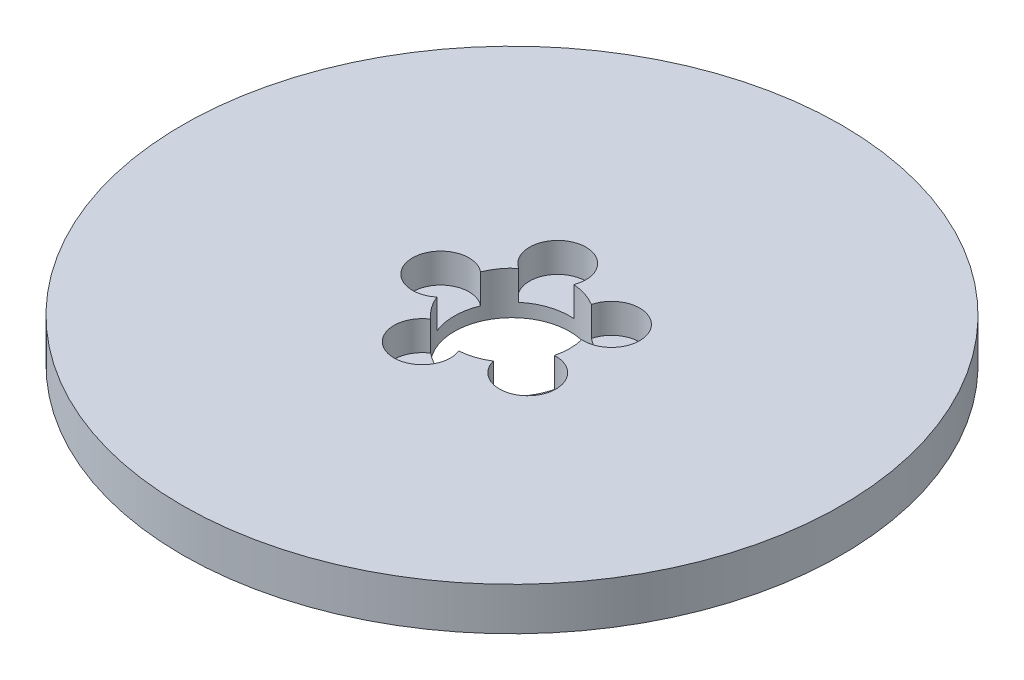
ISO-10303-21;
HEADER;
FILE_DESCRIPTION(('STEP AP214'),'2;1');
FILE_NAME('part.step','',(''),(''),'','','');
FILE_SCHEMA(('AUTOMOTIVE_DESIGN { 1 0 10303 214 1 1 1 1 }'));
ENDSEC;
DATA;
#1=APPLICATION_CONTEXT('core data for automotive mechanical design processes');
#2=APPLICATION_PROTOCOL_DEFINITION('international standard','automotive_design',2000,#1);
#3=PRODUCT_CONTEXT('',#1,'mechanical');
#4=PRODUCT('Part','Part','',(#3));
#5=PRODUCT_RELATED_PRODUCT_CATEGORY('part','',(#4));
#6=PRODUCT_DEFINITION_FORMATION('','',#4);
#7=PRODUCT_DEFINITION_CONTEXT('part definition',#1,'design');
#8=PRODUCT_DEFINITION('design','',#6,#7);
#9=PRODUCT_DEFINITION_SHAPE('','',#8);
#10=(LENGTH_UNIT() NAMED_UNIT(*) SI_UNIT(.MILLI.,.METRE.));
#11=(NAMED_UNIT(*) PLANE_ANGLE_UNIT() SI_UNIT($,.RADIAN.));
#12=(NAMED_UNIT(*) SI_UNIT($,.STERADIAN.) SOLID_ANGLE_UNIT());
#13=UNCERTAINTY_MEASURE_WITH_UNIT(LENGTH_MEASURE(1.E-05),#10,'distance_accuracy_value','');
#14=(GEOMETRIC_REPRESENTATION_CONTEXT(3) GLOBAL_UNCERTAINTY_ASSIGNED_CONTEXT((#13)) GLOBAL_UNIT_ASSIGNED_CONTEXT((#10,
#11,#12)) REPRESENTATION_CONTEXT('',''));
#15=CARTESIAN_POINT('',(0.,0.,0.));
#16=DIRECTION('',(0.,0.,1.));
#17=DIRECTION('',(1.,0.,0.));
#18=AXIS2_PLACEMENT_3D('',#15,#16,#17);
#19=CARTESIAN_POINT('',(0.,13.,0.));
#20=DIRECTION('',(0.,-1.,0.));
#21=DIRECTION('',(0.,0.,-1.));
#22=AXIS2_PLACEMENT_3D('',#19,#20,#21);
#23=CYLINDRICAL_SURFACE('',#22,100.);
#24=CARTESIAN_POINT('',(0.,13.,0.));
#25=DIRECTION('',(0.,1.,0.));
#26=DIRECTION('',(0.,0.,1.));
#27=AXIS2_PLACEMENT_3D('',#24,#25,#26);
#28=CIRCLE('',#27,100.);
#29=CARTESIAN_POINT('',(0.,13.,-100.));
#30=VERTEX_POINT('',#29);
#31=EDGE_CURVE('E157',#30,#30,#28,.T.);
#32=CARTESIAN_POINT('',(0.,0.,0.));
#33=DIRECTION('',(0.,1.,0.));
#34=DIRECTION('',(0.,0.,1.));
#35=AXIS2_PLACEMENT_3D('',#32,#33,#34);
#36=CIRCLE('',#35,100.);
#37=CARTESIAN_POINT('',(0.,0.,-100.));
#38=VERTEX_POINT('',#37);
#39=EDGE_CURVE('E150',#38,#38,#36,.T.);
#40=CARTESIAN_POINT('',(0.,13.,-100.));
#41=CARTESIAN_POINT('',(0.,12.8645833333333,-100.));
#42=CARTESIAN_POINT('',(0.,12.7291666666667,-100.));
#43=CARTESIAN_POINT('',(0.,12.4583333333333,-100.));
#44=CARTESIAN_POINT('',(0.,12.3229166666667,-100.));
#45=CARTESIAN_POINT('',(0.,12.0520833333333,-100.));
#46=CARTESIAN_POINT('',(0.,11.9166666666667,-100.));
#47=CARTESIAN_POINT('',(0.,11.6458333333333,-100.));
#48=CARTESIAN_POINT('',(0.,11.5104166666667,-100.));
#49=CARTESIAN_POINT('',(0.,11.2395833333333,-100.));
#50=CARTESIAN_POINT('',(0.,11.1041666666667,-100.));
#51=CARTESIAN_POINT('',(0.,10.8333333333333,-100.));
#52=CARTESIAN_POINT('',(0.,10.6979166666667,-100.));
#53=CARTESIAN_POINT('',(0.,10.4270833333333,-100.));
#54=CARTESIAN_POINT('',(0.,10.2916666666667,-100.));
#55=CARTESIAN_POINT('',(0.,10.0208333333333,-100.));
#56=CARTESIAN_POINT('',(0.,9.88541666666667,-100.));
#57=CARTESIAN_POINT('',(0.,9.61458333333333,-100.));
#58=CARTESIAN_POINT('',(0.,9.47916666666667,-100.));
#59=CARTESIAN_POINT('',(0.,9.20833333333333,-100.));
#60=CARTESIAN_POINT('',(0.,9.07291666666666,-100.));
#61=CARTESIAN_POINT('',(0.,8.80208333333333,-100.));
#62=CARTESIAN_POINT('',(0.,8.66666666666667,-100.));
#63=CARTESIAN_POINT('',(0.,8.39583333333333,-100.));
#64=CARTESIAN_POINT('',(0.,8.26041666666667,-100.));
#65=CARTESIAN_POINT('',(0.,7.98958333333333,-100.));
#66=CARTESIAN_POINT('',(0.,7.85416666666667,-100.));
#67=CARTESIAN_POINT('',(0.,7.58333333333333,-100.));
#68=CARTESIAN_POINT('',(0.,7.44791666666667,-100.));
#69=CARTESIAN_POINT('',(0.,7.17708333333333,-100.));
#70=CARTESIAN_POINT('',(0.,7.04166666666667,-100.));
#71=CARTESIAN_POINT('',(0.,6.77083333333333,-100.));
#72=CARTESIAN_POINT('',(0.,6.63541666666667,-100.));
#73=CARTESIAN_POINT('',(0.,6.36458333333333,-100.));
#74=CARTESIAN_POINT('',(0.,6.22916666666667,-100.));
#75=CARTESIAN_POINT('',(0.,5.95833333333333,-100.));
#76=CARTESIAN_POINT('',(0.,5.82291666666667,-100.));
#77=CARTESIAN_POINT('',(0.,5.55208333333333,-100.));
#78=CARTESIAN_POINT('',(0.,5.41666666666667,-100.));
#79=CARTESIAN_POINT('',(0.,5.14583333333333,-100.));
#80=CARTESIAN_POINT('',(0.,5.01041666666667,-100.));
#81=CARTESIAN_POINT('',(0.,4.73958333333333,-100.));
#82=CARTESIAN_POINT('',(0.,4.60416666666667,-100.));
#83=CARTESIAN_POINT('',(0.,4.33333333333333,-100.));
#84=CARTESIAN_POINT('',(0.,4.19791666666667,-100.));
#85=CARTESIAN_POINT('',(0.,3.92708333333333,-100.));
#86=CARTESIAN_POINT('',(0.,3.79166666666667,-100.));
#87=CARTESIAN_POINT('',(0.,3.52083333333333,-100.));
#88=CARTESIAN_POINT('',(0.,3.38541666666667,-100.));
#89=CARTESIAN_POINT('',(0.,3.11458333333333,-100.));
#90=CARTESIAN_POINT('',(0.,2.97916666666667,-100.));
#91=CARTESIAN_POINT('',(0.,2.70833333333333,-100.));
#92=CARTESIAN_POINT('',(0.,2.57291666666667,-100.));
#93=CARTESIAN_POINT('',(0.,2.30208333333333,-100.));
#94=CARTESIAN_POINT('',(0.,2.16666666666667,-100.));
#95=CARTESIAN_POINT('',(0.,1.89583333333333,-100.));
#96=CARTESIAN_POINT('',(0.,1.76041666666667,-100.));
#97=CARTESIAN_POINT('',(0.,1.48958333333333,-100.));
#98=CARTESIAN_POINT('',(0.,1.35416666666667,-100.));
#99=CARTESIAN_POINT('',(0.,1.08333333333333,-100.));
#100=CARTESIAN_POINT('',(0.,0.947916666666667,-100.));
#101=CARTESIAN_POINT('',(0.,0.677083333333334,-100.));
#102=CARTESIAN_POINT('',(0.,0.541666666666667,-100.));
#103=CARTESIAN_POINT('',(0.,0.270833333333334,-100.));
#104=CARTESIAN_POINT('',(0.,0.135416666666667,-100.));
#105=CARTESIAN_POINT('',(0.,0.,-100.));
#106=B_SPLINE_CURVE_WITH_KNOTS('',3,(#40,#41,#42,#43,#44,#45,#46,#47,#48,#49,#50,#51,#52,#53,
#54,#55,#56,#57,#58,#59,#60,#61,#62,#63,#64,#65,#66,#67,#68,#69,#70,#71,#72,#73,#74,#75,#76,#77,
#78,#79,#80,#81,#82,#83,#84,#85,#86,#87,#88,#89,#90,#91,#92,#93,#94,#95,#96,#97,#98,#99,#100,
#101,#102,#103,#104,#105),.UNSPECIFIED.,.F.,.F.,(4,2,2,2,2,2,2,2,2,2,2,2,2,2,2,2,2,2,2,2,2,2,2,
2,2,2,2,2,2,2,2,2,4),(0.,0.40625,0.812500000000001,1.21875,1.625,2.03125,2.4375,2.84375,3.25,
3.65625,4.0625,4.46875,4.875,5.28125,5.6875,6.09375,6.5,6.90625,7.3125,7.71875,8.125,8.53125,
8.9375,9.34375,9.75,10.15625,10.5625,10.96875,11.375,11.78125,12.1875,12.59375,13.),.UNSPECIFIED.);
#107=EDGE_CURVE('BSEAM39',#30,#38,#106,.T.);
#108=ORIENTED_EDGE('',*,*,#31,.F.);
#109=ORIENTED_EDGE('',*,*,#39,.T.);
#110=ORIENTED_EDGE('',*,*,#107,.T.);
#111=ORIENTED_EDGE('',*,*,#107,.F.);
#112=EDGE_LOOP('',(#108,#110,#109,#111));
#113=FACE_BOUND('',#112,.T.);
#114=ADVANCED_FACE('F39',(#113),#23,.T.);
#115=CARTESIAN_POINT('',(0.,13.,0.));
#116=DIRECTION('',(0.,1.,0.));
#117=DIRECTION('',(0.,0.,1.));
#118=AXIS2_PLACEMENT_3D('',#115,#116,#117);
#119=PLANE('',#118);
#120=CARTESIAN_POINT('',(-6.68037932786835,13.,-20.5600934794655));
#121=DIRECTION('',(0.,1.,0.));
#122=DIRECTION('',(-0.95105651629515,0.,0.309016994374958));
#123=AXIS2_PLACEMENT_3D('',#120,#121,#122);
#124=CIRCLE('',#123,8.57014910752635);
#125=CARTESIAN_POINT('',(1.30599873361544,13.,-17.4511995950936));
#126=VERTEX_POINT('',#125);
#127=CARTESIAN_POINT('',(-11.3141329269358,13.,-13.3506702495279));
#128=VERTEX_POINT('',#127);
#129=EDGE_CURVE('E194',#126,#128,#124,.T.);
#130=ORIENTED_EDGE('',*,*,#129,.F.);
#131=CARTESIAN_POINT('',(0.,13.,0.));
#132=DIRECTION('',(0.,1.,0.));
#133=DIRECTION('',(0.,0.,1.));
#134=AXIS2_PLACEMENT_3D('',#131,#132,#133);
#135=CIRCLE('',#134,17.5);
#136=CARTESIAN_POINT('',(9.20098258668104,13.,-14.8859638397919));
#137=VERTEX_POINT('',#136);
#138=EDGE_CURVE('E147',#137,#126,#135,.T.);
#139=ORIENTED_EDGE('',*,*,#138,.F.);
#140=CARTESIAN_POINT('',(17.4894601381008,13.,-12.706836582185));
#141=DIRECTION('',(0.,1.,0.));
#142=DIRECTION('',(-0.58778525229248,0.,-0.809016994374942));
#143=AXIS2_PLACEMENT_3D('',#140,#141,#142);
#144=CIRCLE('',#143,8.57014910752635);
#145=CARTESIAN_POINT('',(17.0006528954005,13.,-4.15063864123489));
#146=VERTEX_POINT('',#145);
#147=EDGE_CURVE('E254',#146,#137,#144,.T.);
#148=ORIENTED_EDGE('',*,*,#147,.F.);
#149=CARTESIAN_POINT('',(17.0006528954005,13.,4.15063864123465));
#150=VERTEX_POINT('',#149);
#151=EDGE_CURVE('E144',#150,#146,#135,.T.);
#152=ORIENTED_EDGE('',*,*,#151,.F.);
#153=CARTESIAN_POINT('',(17.489460138101,13.,12.7068365821847));
#154=DIRECTION('',(0.,1.,0.));
#155=DIRECTION('',(0.587785252292469,0.,-0.809016994374951));
#156=AXIS2_PLACEMENT_3D('',#153,#154,#155);
#157=CIRCLE('',#156,8.57014910752635);
#158=CARTESIAN_POINT('',(9.20098258668126,13.,14.8859638397918));
#159=VERTEX_POINT('',#158);
#160=EDGE_CURVE('E141',#159,#150,#157,.T.);
#161=ORIENTED_EDGE('',*,*,#160,.F.);
#162=CARTESIAN_POINT('',(1.30599873361569,13.,17.4511995950936));
#163=VERTEX_POINT('',#162);
#164=EDGE_CURVE('E134',#163,#159,#135,.T.);
#165=ORIENTED_EDGE('',*,*,#164,.F.);
#166=CARTESIAN_POINT('',(-6.68037932786806,13.,20.5600934794656));
#167=DIRECTION('',(0.,1.,0.));
#168=DIRECTION('',(0.951056516295155,0.,0.309016994374945));
#169=AXIS2_PLACEMENT_3D('',#166,#167,#168);
#170=CIRCLE('',#169,8.57014910752635);
#171=CARTESIAN_POINT('',(-11.3141329269356,13.,13.350670249528));
#172=VERTEX_POINT('',#171);
#173=EDGE_CURVE('E111',#172,#163,#170,.T.);
#174=ORIENTED_EDGE('',*,*,#173,.F.);
#175=CARTESIAN_POINT('',(-16.1935012887617,13.,6.63479585299149));
#176=VERTEX_POINT('',#175);
#177=EDGE_CURVE('E145',#176,#172,#135,.T.);
#178=ORIENTED_EDGE('',*,*,#177,.F.);
#179=CARTESIAN_POINT('',(-21.6181616204656,13.,0.));
#180=DIRECTION('',(0.,1.,0.));
#181=DIRECTION('',(0.,0.,1.));
#182=AXIS2_PLACEMENT_3D('',#179,#180,#181);
#183=CIRCLE('',#182,8.57014910752635);
#184=CARTESIAN_POINT('',(-16.1935012887617,13.,-6.63479585299149));
#185=VERTEX_POINT('',#184);
#186=EDGE_CURVE('E153',#185,#176,#183,.T.);
#187=ORIENTED_EDGE('',*,*,#186,.F.);
#188=EDGE_CURVE('E146',#128,#185,#135,.T.);
#189=ORIENTED_EDGE('',*,*,#188,.F.);
#190=EDGE_LOOP('',(#130,#139,#148,#152,#161,#165,#174,#178,#187,#189));
#191=FACE_BOUND('',#190,.T.);
#192=ORIENTED_EDGE('',*,*,#31,.T.);
#193=EDGE_LOOP('',(#192));
#194=FACE_BOUND('',#193,.T.);
#195=ADVANCED_FACE('F139',(#191,#194),#119,.T.);
#196=CARTESIAN_POINT('',(0.,0.,0.));
#197=DIRECTION('',(0.,1.,0.));
#198=DIRECTION('',(0.,0.,1.));
#199=AXIS2_PLACEMENT_3D('',#196,#197,#198);
#200=PLANE('',#199);
#201=CARTESIAN_POINT('',(0.,0.,0.));
#202=DIRECTION('',(0.,1.,0.));
#203=DIRECTION('',(0.,0.,1.));
#204=AXIS2_PLACEMENT_3D('',#201,#202,#203);
#205=CIRCLE('',#204,17.5);
#206=CARTESIAN_POINT('',(0.,0.,17.5));
#207=VERTEX_POINT('',#206);
#208=EDGE_CURVE('E154',#207,#207,#205,.T.);
#209=ORIENTED_EDGE('',*,*,#208,.T.);
#210=EDGE_LOOP('',(#209));
#211=FACE_BOUND('',#210,.T.);
#212=ORIENTED_EDGE('',*,*,#39,.F.);
#213=EDGE_LOOP('',(#212));
#214=FACE_BOUND('',#213,.T.);
#215=ADVANCED_FACE('F213',(#211,#214),#200,.F.);
#216=CARTESIAN_POINT('',(0.,13.,0.));
#217=DIRECTION('',(0.,-1.,0.));
#218=DIRECTION('',(0.,0.,-1.));
#219=AXIS2_PLACEMENT_3D('',#216,#217,#218);
#220=CYLINDRICAL_SURFACE('',#219,17.5);
#221=DIRECTION('',(0.,1.,0.));
#222=VECTOR('',#221,1.);
#223=CARTESIAN_POINT('',(1.30599873361544,8.53133186818055,-17.4511995950936));
#224=LINE('',#223,#222);
#225=CARTESIAN_POINT('',(1.30599873361544,4.06266373636111,-17.4511995950936));
#226=VERTEX_POINT('',#225);
#227=EDGE_CURVE('E11',#226,#126,#224,.T.);
#228=ORIENTED_EDGE('',*,*,#227,.F.);
#229=CARTESIAN_POINT('',(0.,4.06266373636111,0.));
#230=DIRECTION('',(0.,1.,0.));
#231=DIRECTION('',(0.,0.,1.));
#232=AXIS2_PLACEMENT_3D('',#229,#230,#231);
#233=CIRCLE('',#232,17.5);
#234=CARTESIAN_POINT('',(-11.3141329269358,4.06266373636111,-13.3506702495279));
#235=VERTEX_POINT('',#234);
#236=EDGE_CURVE('E189',#226,#235,#233,.T.);
#237=ORIENTED_EDGE('',*,*,#236,.T.);
#238=DIRECTION('',(0.,1.,0.));
#239=VECTOR('',#238,1.);
#240=CARTESIAN_POINT('',(-11.3141329269358,8.53133186818055,-13.3506702495279));
#241=LINE('',#240,#239);
#242=EDGE_CURVE('E46',#128,#235,#241,.F.);
#243=ORIENTED_EDGE('',*,*,#242,.F.);
#244=ORIENTED_EDGE('',*,*,#188,.T.);
#245=DIRECTION('',(0.,1.,0.));
#246=VECTOR('',#245,1.);
#247=CARTESIAN_POINT('',(-16.1935012887617,8.53133186818055,-6.63479585299149));
#248=LINE('',#247,#246);
#249=CARTESIAN_POINT('',(-16.1935012887617,4.06266373636111,-6.63479585299149));
#250=VERTEX_POINT('',#249);
#251=EDGE_CURVE('E168',#250,#185,#248,.T.);
#252=ORIENTED_EDGE('',*,*,#251,.F.);
#253=CARTESIAN_POINT('',(0.,4.06266373636111,0.));
#254=DIRECTION('',(0.,1.,0.));
#255=DIRECTION('',(0.,0.,1.));
#256=AXIS2_PLACEMENT_3D('',#253,#254,#255);
#257=CIRCLE('',#256,17.5);
#258=CARTESIAN_POINT('',(-16.1935012887617,4.06266373636111,6.63479585299149));
#259=VERTEX_POINT('',#258);
#260=EDGE_CURVE('E165',#250,#259,#257,.T.);
#261=ORIENTED_EDGE('',*,*,#260,.T.);
#262=DIRECTION('',(0.,1.,0.));
#263=VECTOR('',#262,1.);
#264=CARTESIAN_POINT('',(-16.1935012887617,8.53133186818055,6.63479585299149));
#265=LINE('',#264,#263);
#266=EDGE_CURVE('E170',#176,#259,#265,.F.);
#267=ORIENTED_EDGE('',*,*,#266,.F.);
#268=ORIENTED_EDGE('',*,*,#177,.T.);
#269=DIRECTION('',(0.,1.,0.));
#270=VECTOR('',#269,1.);
#271=CARTESIAN_POINT('',(-11.3141329269356,8.53133186818055,13.350670249528));
#272=LINE('',#271,#270);
#273=CARTESIAN_POINT('',(-11.3141329269356,4.06266373636111,13.350670249528));
#274=VERTEX_POINT('',#273);
#275=EDGE_CURVE('E121',#274,#172,#272,.T.);
#276=ORIENTED_EDGE('',*,*,#275,.F.);
#277=CARTESIAN_POINT('',(0.,4.06266373636111,0.));
#278=DIRECTION('',(0.,1.,0.));
#279=DIRECTION('',(0.,0.,1.));
#280=AXIS2_PLACEMENT_3D('',#277,#278,#279);
#281=CIRCLE('',#280,17.5);
#282=CARTESIAN_POINT('',(1.30599873361569,4.06266373636111,17.4511995950936));
#283=VERTEX_POINT('',#282);
#284=EDGE_CURVE('E136',#274,#283,#281,.T.);
#285=ORIENTED_EDGE('',*,*,#284,.T.);
#286=DIRECTION('',(0.,1.,0.));
#287=VECTOR('',#286,1.);
#288=CARTESIAN_POINT('',(1.30599873361569,8.53133186818055,17.4511995950936));
#289=LINE('',#288,#287);
#290=EDGE_CURVE('E117',#163,#283,#289,.F.);
#291=ORIENTED_EDGE('',*,*,#290,.F.);
#292=ORIENTED_EDGE('',*,*,#164,.T.);
#293=DIRECTION('',(0.,1.,0.));
#294=VECTOR('',#293,1.);
#295=CARTESIAN_POINT('',(9.20098258668126,8.53133186818055,14.8859638397918));
#296=LINE('',#295,#294);
#297=CARTESIAN_POINT('',(9.20098258668126,4.06266373636111,14.8859638397918));
#298=VERTEX_POINT('',#297);
#299=EDGE_CURVE('E182',#298,#159,#296,.T.);
#300=ORIENTED_EDGE('',*,*,#299,.F.);
#301=CARTESIAN_POINT('',(0.,4.06266373636111,0.));
#302=DIRECTION('',(0.,1.,0.));
#303=DIRECTION('',(0.,0.,1.));
#304=AXIS2_PLACEMENT_3D('',#301,#302,#303);
#305=CIRCLE('',#304,17.5);
#306=CARTESIAN_POINT('',(17.0006528954005,4.06266373636111,4.15063864123465));
#307=VERTEX_POINT('',#306);
#308=EDGE_CURVE('E174',#298,#307,#305,.T.);
#309=ORIENTED_EDGE('',*,*,#308,.T.);
#310=DIRECTION('',(0.,1.,0.));
#311=VECTOR('',#310,1.);
#312=CARTESIAN_POINT('',(17.0006528954005,8.53133186818055,4.15063864123465));
#313=LINE('',#312,#311);
#314=EDGE_CURVE('E177',#150,#307,#313,.F.);
#315=ORIENTED_EDGE('',*,*,#314,.F.);
#316=ORIENTED_EDGE('',*,*,#151,.T.);
#317=DIRECTION('',(0.,1.,0.));
#318=VECTOR('',#317,1.);
#319=CARTESIAN_POINT('',(17.0006528954005,8.53133186818055,-4.15063864123489));
#320=LINE('',#319,#318);
#321=CARTESIAN_POINT('',(17.0006528954005,4.06266373636111,-4.15063864123489));
#322=VERTEX_POINT('',#321);
#323=EDGE_CURVE('E187',#322,#146,#320,.T.);
#324=ORIENTED_EDGE('',*,*,#323,.F.);
#325=CARTESIAN_POINT('',(0.,4.06266373636111,0.));
#326=DIRECTION('',(0.,1.,0.));
#327=DIRECTION('',(0.,0.,1.));
#328=AXIS2_PLACEMENT_3D('',#325,#326,#327);
#329=CIRCLE('',#328,17.5);
#330=CARTESIAN_POINT('',(9.20098258668104,4.06266373636111,-14.8859638397919));
#331=VERTEX_POINT('',#330);
#332=EDGE_CURVE('E181',#322,#331,#329,.T.);
#333=ORIENTED_EDGE('',*,*,#332,.T.);
#334=DIRECTION('',(0.,1.,0.));
#335=VECTOR('',#334,1.);
#336=CARTESIAN_POINT('',(9.20098258668104,8.53133186818055,-14.8859638397919));
#337=LINE('',#336,#335);
#338=EDGE_CURVE('E186',#137,#331,#337,.F.);
#339=ORIENTED_EDGE('',*,*,#338,.F.);
#340=ORIENTED_EDGE('',*,*,#138,.T.);
#341=EDGE_LOOP('',(#228,#237,#243,#244,#252,#261,#267,#268,#276,#285,#291,#292,#300,#309,#315,
#316,#324,#333,#339,#340));
#342=FACE_BOUND('',#341,.T.);
#343=ORIENTED_EDGE('',*,*,#208,.F.);
#344=EDGE_LOOP('',(#343));
#345=FACE_BOUND('',#344,.T.);
#346=ADVANCED_FACE('F135',(#342,#345),#220,.F.);
#347=CARTESIAN_POINT('',(-21.6181616204656,4.06266373636111,0.));
#348=DIRECTION('',(0.,1.,0.));
#349=DIRECTION('',(0.,0.,1.));
#350=AXIS2_PLACEMENT_3D('',#347,#348,#349);
#351=CYLINDRICAL_SURFACE('',#350,8.57014910752635);
#352=ORIENTED_EDGE('',*,*,#251,.T.);
#353=ORIENTED_EDGE('',*,*,#186,.T.);
#354=ORIENTED_EDGE('',*,*,#266,.T.);
#355=CARTESIAN_POINT('',(-21.6181616204656,4.06266373636111,0.));
#356=DIRECTION('',(0.,1.,0.));
#357=DIRECTION('',(0.,0.,1.));
#358=AXIS2_PLACEMENT_3D('',#355,#356,#357);
#359=CIRCLE('',#358,8.57014910752635);
#360=EDGE_CURVE('E158',#250,#259,#359,.T.);
#361=ORIENTED_EDGE('',*,*,#360,.F.);
#362=EDGE_LOOP('',(#352,#353,#354,#361));
#363=FACE_BOUND('',#362,.T.);
#364=ADVANCED_FACE('F221',(#363),#351,.F.);
#365=CARTESIAN_POINT('',(-21.6181616204656,4.06266373636111,0.));
#366=DIRECTION('',(0.,1.,0.));
#367=DIRECTION('',(0.,0.,1.));
#368=AXIS2_PLACEMENT_3D('',#365,#366,#367);
#369=PLANE('',#368);
#370=ORIENTED_EDGE('',*,*,#360,.T.);
#371=ORIENTED_EDGE('',*,*,#260,.F.);
#372=EDGE_LOOP('',(#370,#371));
#373=FACE_BOUND('',#372,.T.);
#374=ADVANCED_FACE('F227',(#373),#369,.T.);
#375=CARTESIAN_POINT('',(-6.68037932786806,4.06266373636111,20.5600934794656));
#376=DIRECTION('',(0.,1.,0.));
#377=DIRECTION('',(0.,0.,1.));
#378=AXIS2_PLACEMENT_3D('',#375,#376,#377);
#379=CYLINDRICAL_SURFACE('',#378,8.57014910752635);
#380=ORIENTED_EDGE('',*,*,#275,.T.);
#381=ORIENTED_EDGE('',*,*,#173,.T.);
#382=ORIENTED_EDGE('',*,*,#290,.T.);
#383=CARTESIAN_POINT('',(-6.68037932786806,4.06266373636111,20.5600934794656));
#384=DIRECTION('',(0.,1.,0.));
#385=DIRECTION('',(0.951056516295155,0.,0.309016994374945));
#386=AXIS2_PLACEMENT_3D('',#383,#384,#385);
#387=CIRCLE('',#386,8.57014910752635);
#388=EDGE_CURVE('E127',#274,#283,#387,.T.);
#389=ORIENTED_EDGE('',*,*,#388,.F.);
#390=EDGE_LOOP('',(#380,#381,#382,#389));
#391=FACE_BOUND('',#390,.T.);
#392=ADVANCED_FACE('F116',(#391),#379,.F.);
#393=CARTESIAN_POINT('',(-6.68037932786806,4.06266373636111,20.5600934794656));
#394=DIRECTION('',(0.,1.,0.));
#395=DIRECTION('',(0.951056516295155,0.,0.309016994374945));
#396=AXIS2_PLACEMENT_3D('',#393,#394,#395);
#397=PLANE('',#396);
#398=ORIENTED_EDGE('',*,*,#388,.T.);
#399=ORIENTED_EDGE('',*,*,#284,.F.);
#400=EDGE_LOOP('',(#398,#399));
#401=FACE_BOUND('',#400,.T.);
#402=ADVANCED_FACE('F234',(#401),#397,.T.);
#403=CARTESIAN_POINT('',(17.489460138101,4.06266373636111,12.7068365821847));
#404=DIRECTION('',(0.,1.,0.));
#405=DIRECTION('',(0.,0.,1.));
#406=AXIS2_PLACEMENT_3D('',#403,#404,#405);
#407=CYLINDRICAL_SURFACE('',#406,8.57014910752635);
#408=ORIENTED_EDGE('',*,*,#299,.T.);
#409=ORIENTED_EDGE('',*,*,#160,.T.);
#410=ORIENTED_EDGE('',*,*,#314,.T.);
#411=CARTESIAN_POINT('',(17.489460138101,4.06266373636111,12.7068365821847));
#412=DIRECTION('',(0.,1.,0.));
#413=DIRECTION('',(0.587785252292469,0.,-0.809016994374951));
#414=AXIS2_PLACEMENT_3D('',#411,#412,#413);
#415=CIRCLE('',#414,8.57014910752635);
#416=EDGE_CURVE('E130',#298,#307,#415,.T.);
#417=ORIENTED_EDGE('',*,*,#416,.F.);
#418=EDGE_LOOP('',(#408,#409,#410,#417));
#419=FACE_BOUND('',#418,.T.);
#420=ADVANCED_FACE('F240',(#419),#407,.F.);
#421=CARTESIAN_POINT('',(17.489460138101,4.06266373636111,12.7068365821847));
#422=DIRECTION('',(0.,1.,0.));
#423=DIRECTION('',(0.587785252292469,0.,-0.809016994374951));
#424=AXIS2_PLACEMENT_3D('',#421,#422,#423);
#425=PLANE('',#424);
#426=ORIENTED_EDGE('',*,*,#416,.T.);
#427=ORIENTED_EDGE('',*,*,#308,.F.);
#428=EDGE_LOOP('',(#426,#427));
#429=FACE_BOUND('',#428,.T.);
#430=ADVANCED_FACE('F245',(#429),#425,.T.);
#431=CARTESIAN_POINT('',(17.4894601381008,4.06266373636111,-12.706836582185));
#432=DIRECTION('',(0.,1.,0.));
#433=DIRECTION('',(0.,0.,1.));
#434=AXIS2_PLACEMENT_3D('',#431,#432,#433);
#435=CYLINDRICAL_SURFACE('',#434,8.57014910752635);
#436=ORIENTED_EDGE('',*,*,#323,.T.);
#437=ORIENTED_EDGE('',*,*,#147,.T.);
#438=ORIENTED_EDGE('',*,*,#338,.T.);
#439=CARTESIAN_POINT('',(17.4894601381008,4.06266373636111,-12.706836582185));
#440=DIRECTION('',(0.,1.,0.));
#441=DIRECTION('',(-0.58778525229248,0.,-0.809016994374942));
#442=AXIS2_PLACEMENT_3D('',#439,#440,#441);
#443=CIRCLE('',#442,8.57014910752635);
#444=EDGE_CURVE('E56',#322,#331,#443,.T.);
#445=ORIENTED_EDGE('',*,*,#444,.F.);
#446=EDGE_LOOP('',(#436,#437,#438,#445));
#447=FACE_BOUND('',#446,.T.);
#448=ADVANCED_FACE('F266',(#447),#435,.F.);
#449=CARTESIAN_POINT('',(17.4894601381008,4.06266373636111,-12.706836582185));
#450=DIRECTION('',(0.,1.,0.));
#451=DIRECTION('',(-0.58778525229248,0.,-0.809016994374942));
#452=AXIS2_PLACEMENT_3D('',#449,#450,#451);
#453=PLANE('',#452);
#454=ORIENTED_EDGE('',*,*,#444,.T.);
#455=ORIENTED_EDGE('',*,*,#332,.F.);
#456=EDGE_LOOP('',(#454,#455));
#457=FACE_BOUND('',#456,.T.);
#458=ADVANCED_FACE('F204',(#457),#453,.T.);
#459=CARTESIAN_POINT('',(-6.68037932786835,4.06266373636111,-20.5600934794655));
#460=DIRECTION('',(0.,1.,0.));
#461=DIRECTION('',(0.,0.,1.));
#462=AXIS2_PLACEMENT_3D('',#459,#460,#461);
#463=CYLINDRICAL_SURFACE('',#462,8.57014910752635);
#464=ORIENTED_EDGE('',*,*,#227,.T.);
#465=ORIENTED_EDGE('',*,*,#129,.T.);
#466=ORIENTED_EDGE('',*,*,#242,.T.);
#467=CARTESIAN_POINT('',(-6.68037932786835,4.06266373636111,-20.5600934794655));
#468=DIRECTION('',(0.,1.,0.));
#469=DIRECTION('',(-0.95105651629515,0.,0.309016994374958));
#470=AXIS2_PLACEMENT_3D('',#467,#468,#469);
#471=CIRCLE('',#470,8.57014910752635);
#472=EDGE_CURVE('E55',#226,#235,#471,.T.);
#473=ORIENTED_EDGE('',*,*,#472,.F.);
#474=EDGE_LOOP('',(#464,#465,#466,#473));
#475=FACE_BOUND('',#474,.T.);
#476=ADVANCED_FACE('F193',(#475),#463,.F.);
#477=CARTESIAN_POINT('',(-6.68037932786835,4.06266373636111,-20.5600934794655));
#478=DIRECTION('',(0.,1.,0.));
#479=DIRECTION('',(-0.95105651629515,0.,0.309016994374958));
#480=AXIS2_PLACEMENT_3D('',#477,#478,#479);
#481=PLANE('',#480);
#482=ORIENTED_EDGE('',*,*,#472,.T.);
#483=ORIENTED_EDGE('',*,*,#236,.F.);
#484=EDGE_LOOP('',(#482,#483));
#485=FACE_BOUND('',#484,.T.);
#486=ADVANCED_FACE('F196',(#485),#481,.T.);
#487=CLOSED_SHELL('',(#114,#195,#215,#346,#364,#374,#392,#402,#420,#430,#448,#458,#476,#486));
#488=MANIFOLD_SOLID_BREP('B2',#487);
#489=ADVANCED_BREP_SHAPE_REPRESENTATION('',(#18,#488),#14);
#490=SHAPE_DEFINITION_REPRESENTATION(#9,#489);
ENDSEC;
END-ISO-10303-21;
